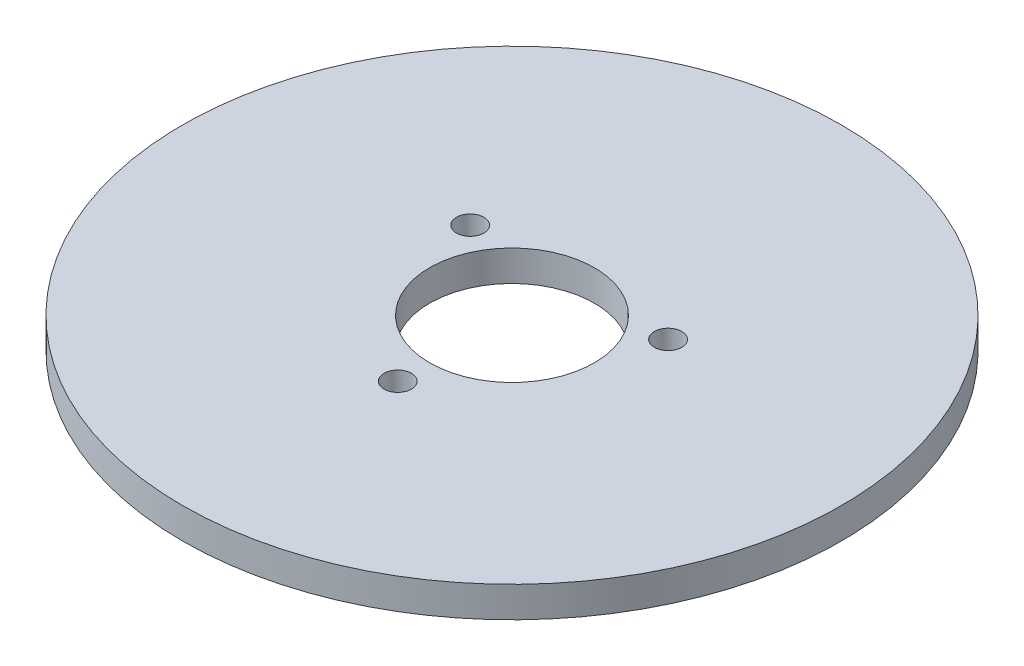
ISO-10303-21;
HEADER;
FILE_DESCRIPTION(('STEP AP214'),'2;1');
FILE_NAME('part.step','',(''),(''),'','','');
FILE_SCHEMA(('AUTOMOTIVE_DESIGN { 1 0 10303 214 1 1 1 1 }'));
ENDSEC;
DATA;
#1=APPLICATION_CONTEXT('core data for automotive mechanical design processes');
#2=APPLICATION_PROTOCOL_DEFINITION('international standard','automotive_design',2000,#1);
#3=PRODUCT_CONTEXT('',#1,'mechanical');
#4=PRODUCT('Part','Part','',(#3));
#5=PRODUCT_RELATED_PRODUCT_CATEGORY('part','',(#4));
#6=PRODUCT_DEFINITION_FORMATION('','',#4);
#7=PRODUCT_DEFINITION_CONTEXT('part definition',#1,'design');
#8=PRODUCT_DEFINITION('design','',#6,#7);
#9=PRODUCT_DEFINITION_SHAPE('','',#8);
#10=(LENGTH_UNIT() NAMED_UNIT(*) SI_UNIT(.MILLI.,.METRE.));
#11=(NAMED_UNIT(*) PLANE_ANGLE_UNIT() SI_UNIT($,.RADIAN.));
#12=(NAMED_UNIT(*) SI_UNIT($,.STERADIAN.) SOLID_ANGLE_UNIT());
#13=UNCERTAINTY_MEASURE_WITH_UNIT(LENGTH_MEASURE(1.E-05),#10,'distance_accuracy_value','');
#14=(GEOMETRIC_REPRESENTATION_CONTEXT(3) GLOBAL_UNCERTAINTY_ASSIGNED_CONTEXT((#13)) GLOBAL_UNIT_ASSIGNED_CONTEXT((#10,
#11,#12)) REPRESENTATION_CONTEXT('',''));
#15=CARTESIAN_POINT('',(0.,0.,0.));
#16=DIRECTION('',(0.,0.,1.));
#17=DIRECTION('',(1.,0.,0.));
#18=AXIS2_PLACEMENT_3D('',#15,#16,#17);
#19=CARTESIAN_POINT('',(0.,-0.889,0.));
#20=DIRECTION('',(0.,1.,0.));
#21=DIRECTION('',(0.,0.,1.));
#22=AXIS2_PLACEMENT_3D('',#19,#20,#21);
#23=CYLINDRICAL_SURFACE('',#22,19.05);
#24=CARTESIAN_POINT('',(0.,-0.889,0.));
#25=DIRECTION('',(0.,1.,0.));
#26=DIRECTION('',(0.,0.,1.));
#27=AXIS2_PLACEMENT_3D('',#24,#25,#26);
#28=CIRCLE('',#27,19.05);
#29=CARTESIAN_POINT('',(0.,-0.889,19.05));
#30=VERTEX_POINT('',#29);
#31=EDGE_CURVE('E10',#30,#30,#28,.T.);
#32=ORIENTED_EDGE('',*,*,#31,.T.);
#33=EDGE_LOOP('',(#32));
#34=FACE_BOUND('',#33,.T.);
#35=CARTESIAN_POINT('',(0.,0.889,0.));
#36=DIRECTION('',(0.,1.,0.));
#37=DIRECTION('',(0.,0.,1.));
#38=AXIS2_PLACEMENT_3D('',#35,#36,#37);
#39=CIRCLE('',#38,19.05);
#40=CARTESIAN_POINT('',(0.,0.889,19.05));
#41=VERTEX_POINT('',#40);
#42=EDGE_CURVE('E37',#41,#41,#39,.T.);
#43=ORIENTED_EDGE('',*,*,#42,.F.);
#44=EDGE_LOOP('',(#43));
#45=FACE_BOUND('',#44,.T.);
#46=ADVANCED_FACE('F31',(#34,#45),#23,.T.);
#47=CARTESIAN_POINT('',(0.,-0.889,0.));
#48=DIRECTION('',(0.,1.,0.));
#49=DIRECTION('',(0.,0.,1.));
#50=AXIS2_PLACEMENT_3D('',#47,#48,#49);
#51=PLANE('',#50);
#52=CARTESIAN_POINT('',(0.,-0.889,6.604));
#53=DIRECTION('',(0.,-1.,0.));
#54=DIRECTION('',(0.,0.,-1.));
#55=AXIS2_PLACEMENT_3D('',#52,#53,#54);
#56=CIRCLE('',#55,0.79375);
#57=CARTESIAN_POINT('',(0.,-0.889,5.81025));
#58=VERTEX_POINT('',#57);
#59=EDGE_CURVE('E63',#58,#58,#56,.T.);
#60=ORIENTED_EDGE('',*,*,#59,.F.);
#61=EDGE_LOOP('',(#60));
#62=FACE_BOUND('',#61,.T.);
#63=CARTESIAN_POINT('',(5.71923176659271,-0.889,-3.30199999999984));
#64=DIRECTION('',(0.,-1.,0.));
#65=DIRECTION('',(0.,0.,-1.));
#66=AXIS2_PLACEMENT_3D('',#63,#64,#65);
#67=CIRCLE('',#66,0.793750000000252);
#68=CARTESIAN_POINT('',(5.71923176659271,-0.889,-4.09575000000009));
#69=VERTEX_POINT('',#68);
#70=EDGE_CURVE('E57',#69,#69,#67,.T.);
#71=ORIENTED_EDGE('',*,*,#70,.F.);
#72=EDGE_LOOP('',(#71));
#73=FACE_BOUND('',#72,.T.);
#74=CARTESIAN_POINT('',(-5.71923176659215,-0.889,-3.30200000000016));
#75=DIRECTION('',(0.,-1.,0.));
#76=DIRECTION('',(0.,0.,-1.));
#77=AXIS2_PLACEMENT_3D('',#74,#75,#76);
#78=CIRCLE('',#77,0.793750000000376);
#79=CARTESIAN_POINT('',(-5.71923176659215,-0.889,-4.09575000000054));
#80=VERTEX_POINT('',#79);
#81=EDGE_CURVE('E51',#80,#80,#78,.T.);
#82=ORIENTED_EDGE('',*,*,#81,.F.);
#83=EDGE_LOOP('',(#82));
#84=FACE_BOUND('',#83,.T.);
#85=CARTESIAN_POINT('',(0.,-0.889,0.));
#86=DIRECTION('',(0.,1.,0.));
#87=DIRECTION('',(0.,0.,1.));
#88=AXIS2_PLACEMENT_3D('',#85,#86,#87);
#89=CIRCLE('',#88,4.7625);
#90=CARTESIAN_POINT('',(0.,-0.889,4.7625));
#91=VERTEX_POINT('',#90);
#92=EDGE_CURVE('E41',#91,#91,#89,.T.);
#93=ORIENTED_EDGE('',*,*,#92,.T.);
#94=EDGE_LOOP('',(#93));
#95=FACE_BOUND('',#94,.T.);
#96=ORIENTED_EDGE('',*,*,#31,.F.);
#97=EDGE_LOOP('',(#96));
#98=FACE_BOUND('',#97,.T.);
#99=ADVANCED_FACE('F79',(#62,#73,#84,#95,#98),#51,.F.);
#100=CARTESIAN_POINT('',(0.,0.889,0.));
#101=DIRECTION('',(0.,1.,0.));
#102=DIRECTION('',(0.,0.,1.));
#103=AXIS2_PLACEMENT_3D('',#100,#101,#102);
#104=PLANE('',#103);
#105=CARTESIAN_POINT('',(0.,0.889,6.604));
#106=DIRECTION('',(0.,-1.,0.));
#107=DIRECTION('',(0.,0.,-1.));
#108=AXIS2_PLACEMENT_3D('',#105,#106,#107);
#109=CIRCLE('',#108,0.79375);
#110=CARTESIAN_POINT('',(0.,0.889,5.81025));
#111=VERTEX_POINT('',#110);
#112=EDGE_CURVE('E49',#111,#111,#109,.T.);
#113=ORIENTED_EDGE('',*,*,#112,.T.);
#114=EDGE_LOOP('',(#113));
#115=FACE_BOUND('',#114,.T.);
#116=CARTESIAN_POINT('',(5.71923176659271,0.889,-3.30199999999984));
#117=DIRECTION('',(0.,-1.,0.));
#118=DIRECTION('',(0.,0.,-1.));
#119=AXIS2_PLACEMENT_3D('',#116,#117,#118);
#120=CIRCLE('',#119,0.793750000000252);
#121=CARTESIAN_POINT('',(5.71923176659271,0.889,-4.09575000000009));
#122=VERTEX_POINT('',#121);
#123=EDGE_CURVE('E60',#122,#122,#120,.T.);
#124=ORIENTED_EDGE('',*,*,#123,.T.);
#125=EDGE_LOOP('',(#124));
#126=FACE_BOUND('',#125,.T.);
#127=CARTESIAN_POINT('',(-5.71923176659215,0.889,-3.30200000000016));
#128=DIRECTION('',(0.,-1.,0.));
#129=DIRECTION('',(0.,0.,-1.));
#130=AXIS2_PLACEMENT_3D('',#127,#128,#129);
#131=CIRCLE('',#130,0.793750000000376);
#132=CARTESIAN_POINT('',(-5.71923176659215,0.889,-4.09575000000054));
#133=VERTEX_POINT('',#132);
#134=EDGE_CURVE('E54',#133,#133,#131,.T.);
#135=ORIENTED_EDGE('',*,*,#134,.T.);
#136=EDGE_LOOP('',(#135));
#137=FACE_BOUND('',#136,.T.);
#138=CARTESIAN_POINT('',(0.,0.889,0.));
#139=DIRECTION('',(0.,1.,0.));
#140=DIRECTION('',(0.,0.,1.));
#141=AXIS2_PLACEMENT_3D('',#138,#139,#140);
#142=CIRCLE('',#141,4.7625);
#143=CARTESIAN_POINT('',(0.,0.889,4.7625));
#144=VERTEX_POINT('',#143);
#145=EDGE_CURVE('E45',#144,#144,#142,.T.);
#146=ORIENTED_EDGE('',*,*,#145,.F.);
#147=EDGE_LOOP('',(#146));
#148=FACE_BOUND('',#147,.T.);
#149=ORIENTED_EDGE('',*,*,#42,.T.);
#150=EDGE_LOOP('',(#149));
#151=FACE_BOUND('',#150,.T.);
#152=ADVANCED_FACE('F69',(#115,#126,#137,#148,#151),#104,.T.);
#153=CARTESIAN_POINT('',(0.,-0.889,0.));
#154=DIRECTION('',(0.,1.,0.));
#155=DIRECTION('',(0.,0.,1.));
#156=AXIS2_PLACEMENT_3D('',#153,#154,#155);
#157=CYLINDRICAL_SURFACE('',#156,4.7625);
#158=ORIENTED_EDGE('',*,*,#92,.F.);
#159=EDGE_LOOP('',(#158));
#160=FACE_BOUND('',#159,.T.);
#161=ORIENTED_EDGE('',*,*,#145,.T.);
#162=EDGE_LOOP('',(#161));
#163=FACE_BOUND('',#162,.T.);
#164=ADVANCED_FACE('F89',(#160,#163),#157,.F.);
#165=CARTESIAN_POINT('',(-5.71923176659215,0.889,-3.30200000000016));
#166=DIRECTION('',(0.,-1.,0.));
#167=DIRECTION('',(0.,0.,-1.));
#168=AXIS2_PLACEMENT_3D('',#165,#166,#167);
#169=CYLINDRICAL_SURFACE('',#168,0.793750000000376);
#170=ORIENTED_EDGE('',*,*,#134,.F.);
#171=EDGE_LOOP('',(#170));
#172=FACE_BOUND('',#171,.T.);
#173=ORIENTED_EDGE('',*,*,#81,.T.);
#174=EDGE_LOOP('',(#173));
#175=FACE_BOUND('',#174,.T.);
#176=ADVANCED_FACE('F92',(#172,#175),#169,.F.);
#177=CARTESIAN_POINT('',(5.71923176659271,0.889,-3.30199999999984));
#178=DIRECTION('',(0.,-1.,0.));
#179=DIRECTION('',(0.,0.,-1.));
#180=AXIS2_PLACEMENT_3D('',#177,#178,#179);
#181=CYLINDRICAL_SURFACE('',#180,0.793750000000252);
#182=ORIENTED_EDGE('',*,*,#123,.F.);
#183=EDGE_LOOP('',(#182));
#184=FACE_BOUND('',#183,.T.);
#185=ORIENTED_EDGE('',*,*,#70,.T.);
#186=EDGE_LOOP('',(#185));
#187=FACE_BOUND('',#186,.T.);
#188=ADVANCED_FACE('F75',(#184,#187),#181,.F.);
#189=CARTESIAN_POINT('',(0.,0.889,6.604));
#190=DIRECTION('',(0.,-1.,0.));
#191=DIRECTION('',(0.,0.,-1.));
#192=AXIS2_PLACEMENT_3D('',#189,#190,#191);
#193=CYLINDRICAL_SURFACE('',#192,0.79375);
#194=ORIENTED_EDGE('',*,*,#112,.F.);
#195=EDGE_LOOP('',(#194));
#196=FACE_BOUND('',#195,.T.);
#197=ORIENTED_EDGE('',*,*,#59,.T.);
#198=EDGE_LOOP('',(#197));
#199=FACE_BOUND('',#198,.T.);
#200=ADVANCED_FACE('F72',(#196,#199),#193,.F.);
#201=CLOSED_SHELL('',(#46,#99,#152,#164,#176,#188,#200));
#202=MANIFOLD_SOLID_BREP('B2',#201);
#203=ADVANCED_BREP_SHAPE_REPRESENTATION('',(#18,#202),#14);
#204=SHAPE_DEFINITION_REPRESENTATION(#9,#203);
ENDSEC;
END-ISO-10303-21;
